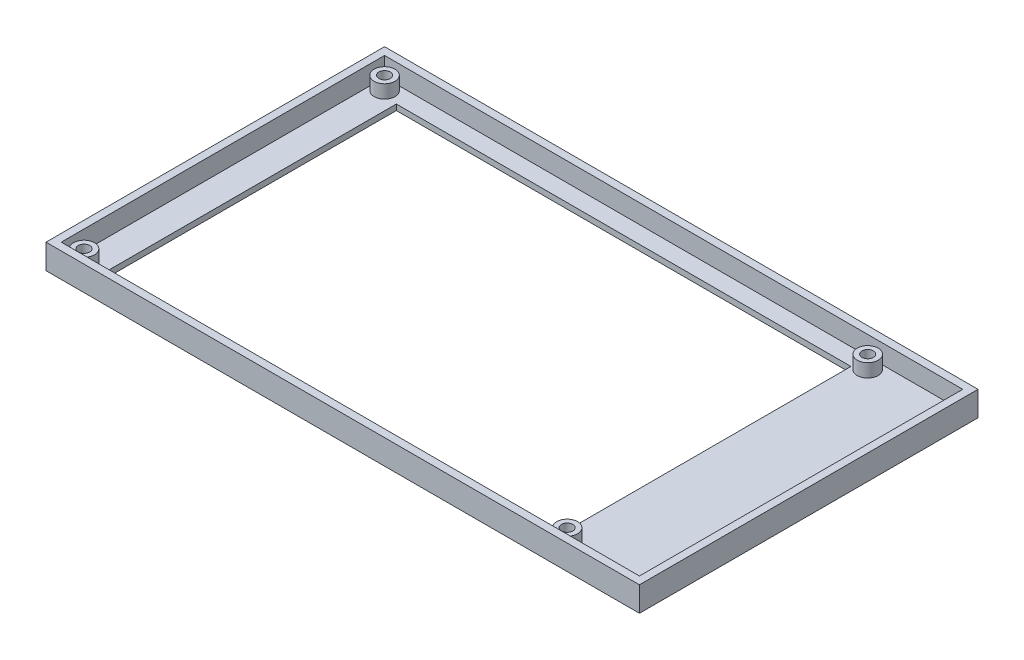
ISO-10303-21;
HEADER;
FILE_DESCRIPTION(('STEP AP214'),'2;1');
FILE_NAME('part.step','',(''),(''),'','','');
FILE_SCHEMA(('AUTOMOTIVE_DESIGN { 1 0 10303 214 1 1 1 1 }'));
ENDSEC;
DATA;
#1=APPLICATION_CONTEXT('core data for automotive mechanical design processes');
#2=APPLICATION_PROTOCOL_DEFINITION('international standard','automotive_design',2000,#1);
#3=PRODUCT_CONTEXT('',#1,'mechanical');
#4=PRODUCT('Part','Part','',(#3));
#5=PRODUCT_RELATED_PRODUCT_CATEGORY('part','',(#4));
#6=PRODUCT_DEFINITION_FORMATION('','',#4);
#7=PRODUCT_DEFINITION_CONTEXT('part definition',#1,'design');
#8=PRODUCT_DEFINITION('design','',#6,#7);
#9=PRODUCT_DEFINITION_SHAPE('','',#8);
#10=(LENGTH_UNIT() NAMED_UNIT(*) SI_UNIT(.MILLI.,.METRE.));
#11=(NAMED_UNIT(*) PLANE_ANGLE_UNIT() SI_UNIT($,.RADIAN.));
#12=(NAMED_UNIT(*) SI_UNIT($,.STERADIAN.) SOLID_ANGLE_UNIT());
#13=UNCERTAINTY_MEASURE_WITH_UNIT(LENGTH_MEASURE(1.E-05),#10,'distance_accuracy_value','');
#14=(GEOMETRIC_REPRESENTATION_CONTEXT(3) GLOBAL_UNCERTAINTY_ASSIGNED_CONTEXT((#13)) GLOBAL_UNIT_ASSIGNED_CONTEXT((#10,
#11,#12)) REPRESENTATION_CONTEXT('',''));
#15=CARTESIAN_POINT('',(0.,0.,0.));
#16=DIRECTION('',(0.,0.,1.));
#17=DIRECTION('',(1.,0.,0.));
#18=AXIS2_PLACEMENT_3D('',#15,#16,#17);
#19=CARTESIAN_POINT('',(0.,1.5,0.));
#20=DIRECTION('',(0.,-1.,0.));
#21=DIRECTION('',(0.,0.,-1.));
#22=AXIS2_PLACEMENT_3D('',#19,#20,#21);
#23=PLANE('',#22);
#24=DIRECTION('',(1.,0.,0.));
#25=VECTOR('',#24,1.);
#26=CARTESIAN_POINT('',(7.6,1.5,-2.));
#27=LINE('',#26,#25);
#28=CARTESIAN_POINT('',(7.6,1.5,-2.));
#29=VERTEX_POINT('',#28);
#30=CARTESIAN_POINT('',(127.1,1.5,-2.));
#31=VERTEX_POINT('',#30);
#32=EDGE_CURVE('E473',#29,#31,#27,.T.);
#33=ORIENTED_EDGE('',*,*,#32,.F.);
#34=DIRECTION('',(0.,0.,1.));
#35=VECTOR('',#34,1.);
#36=CARTESIAN_POINT('',(7.6,1.5,-80.5));
#37=LINE('',#36,#35);
#38=CARTESIAN_POINT('',(7.6,1.5,-80.5));
#39=VERTEX_POINT('',#38);
#40=EDGE_CURVE('E169',#39,#29,#37,.T.);
#41=ORIENTED_EDGE('',*,*,#40,.F.);
#42=DIRECTION('',(-1.,0.,0.));
#43=VECTOR('',#42,1.);
#44=CARTESIAN_POINT('',(7.6,1.5,-80.5));
#45=LINE('',#44,#43);
#46=CARTESIAN_POINT('',(127.1,1.5,-80.5));
#47=VERTEX_POINT('',#46);
#48=EDGE_CURVE('E165',#47,#39,#45,.T.);
#49=ORIENTED_EDGE('',*,*,#48,.F.);
#50=DIRECTION('',(0.,0.,-1.));
#51=VECTOR('',#50,1.);
#52=CARTESIAN_POINT('',(127.1,1.5,-80.5));
#53=LINE('',#52,#51);
#54=EDGE_CURVE('E137',#31,#47,#53,.T.);
#55=ORIENTED_EDGE('',*,*,#54,.F.);
#56=EDGE_LOOP('',(#33,#41,#49,#55));
#57=FACE_BOUND('',#56,.T.);
#58=CARTESIAN_POINT('',(3.,1.5,-3.));
#59=DIRECTION('',(0.,-1.,0.));
#60=DIRECTION('',(0.,0.,-1.));
#61=AXIS2_PLACEMENT_3D('',#58,#59,#60);
#62=CIRCLE('',#61,2.75);
#63=CARTESIAN_POINT('',(3.,1.5,-5.75));
#64=VERTEX_POINT('',#63);
#65=EDGE_CURVE('E11',#64,#64,#62,.F.);
#66=ORIENTED_EDGE('',*,*,#65,.F.);
#67=EDGE_LOOP('',(#66));
#68=FACE_BOUND('',#67,.T.);
#69=CARTESIAN_POINT('',(130.,1.5,-2.99999999999999));
#70=DIRECTION('',(0.,-1.,0.));
#71=DIRECTION('',(0.,0.,-1.));
#72=AXIS2_PLACEMENT_3D('',#69,#70,#71);
#73=CIRCLE('',#72,2.75000000000001);
#74=CARTESIAN_POINT('',(130.,1.5,-5.75));
#75=VERTEX_POINT('',#74);
#76=EDGE_CURVE('E50',#75,#75,#73,.F.);
#77=ORIENTED_EDGE('',*,*,#76,.F.);
#78=EDGE_LOOP('',(#77));
#79=FACE_BOUND('',#78,.T.);
#80=CARTESIAN_POINT('',(130.,1.5,-82.));
#81=DIRECTION('',(0.,-1.,0.));
#82=DIRECTION('',(0.,0.,-1.));
#83=AXIS2_PLACEMENT_3D('',#80,#81,#82);
#84=CIRCLE('',#83,2.75000000000001);
#85=CARTESIAN_POINT('',(130.,1.5,-84.75));
#86=VERTEX_POINT('',#85);
#87=EDGE_CURVE('E274',#86,#86,#84,.F.);
#88=ORIENTED_EDGE('',*,*,#87,.F.);
#89=EDGE_LOOP('',(#88));
#90=FACE_BOUND('',#89,.T.);
#91=CARTESIAN_POINT('',(3.,1.5,-82.));
#92=DIRECTION('',(0.,-1.,0.));
#93=DIRECTION('',(0.,0.,-1.));
#94=AXIS2_PLACEMENT_3D('',#91,#92,#93);
#95=CIRCLE('',#94,2.75);
#96=CARTESIAN_POINT('',(3.,1.5,-84.75));
#97=VERTEX_POINT('',#96);
#98=EDGE_CURVE('E270',#97,#97,#95,.F.);
#99=ORIENTED_EDGE('',*,*,#98,.F.);
#100=EDGE_LOOP('',(#99));
#101=FACE_BOUND('',#100,.T.);
#102=DIRECTION('',(0.,0.,1.));
#103=VECTOR('',#102,1.);
#104=CARTESIAN_POINT('',(0.,1.5,0.));
#105=LINE('',#104,#103);
#106=CARTESIAN_POINT('',(0.,1.5,-85.));
#107=VERTEX_POINT('',#106);
#108=CARTESIAN_POINT('',(0.,1.5,0.));
#109=VERTEX_POINT('',#108);
#110=EDGE_CURVE('E254',#107,#109,#105,.T.);
#111=ORIENTED_EDGE('',*,*,#110,.T.);
#112=DIRECTION('',(1.,0.,0.));
#113=VECTOR('',#112,1.);
#114=CARTESIAN_POINT('',(0.,1.5,0.));
#115=LINE('',#114,#113);
#116=CARTESIAN_POINT('',(152.,1.5,0.));
#117=VERTEX_POINT('',#116);
#118=EDGE_CURVE('E258',#109,#117,#115,.T.);
#119=ORIENTED_EDGE('',*,*,#118,.T.);
#120=DIRECTION('',(0.,0.,-1.));
#121=VECTOR('',#120,1.);
#122=CARTESIAN_POINT('',(152.,1.5,0.));
#123=LINE('',#122,#121);
#124=CARTESIAN_POINT('',(152.,1.5,-85.));
#125=VERTEX_POINT('',#124);
#126=EDGE_CURVE('E262',#117,#125,#123,.T.);
#127=ORIENTED_EDGE('',*,*,#126,.T.);
#128=DIRECTION('',(-1.,0.,0.));
#129=VECTOR('',#128,1.);
#130=CARTESIAN_POINT('',(0.,1.5,-85.));
#131=LINE('',#130,#129);
#132=EDGE_CURVE('E266',#125,#107,#131,.T.);
#133=ORIENTED_EDGE('',*,*,#132,.T.);
#134=EDGE_LOOP('',(#111,#119,#127,#133));
#135=FACE_BOUND('',#134,.T.);
#136=ADVANCED_FACE('F41',(#57,#68,#79,#90,#101,#135),#23,.F.);
#137=CARTESIAN_POINT('',(152.,6.5,-85.));
#138=DIRECTION('',(0.,0.,1.));
#139=DIRECTION('',(1.,0.,0.));
#140=AXIS2_PLACEMENT_3D('',#137,#138,#139);
#141=PLANE('',#140);
#142=ORIENTED_EDGE('',*,*,#132,.F.);
#143=DIRECTION('',(0.,-1.,0.));
#144=VECTOR('',#143,1.);
#145=CARTESIAN_POINT('',(152.,6.5,-85.));
#146=LINE('',#145,#144);
#147=CARTESIAN_POINT('',(152.,6.5,-85.));
#148=VERTEX_POINT('',#147);
#149=EDGE_CURVE('E214',#148,#125,#146,.T.);
#150=ORIENTED_EDGE('',*,*,#149,.F.);
#151=DIRECTION('',(-1.,0.,0.));
#152=VECTOR('',#151,1.);
#153=CARTESIAN_POINT('',(152.,6.5,-85.));
#154=LINE('',#153,#152);
#155=CARTESIAN_POINT('',(0.,6.5,-85.));
#156=VERTEX_POINT('',#155);
#157=EDGE_CURVE('E190',#148,#156,#154,.T.);
#158=ORIENTED_EDGE('',*,*,#157,.T.);
#159=DIRECTION('',(0.,-1.,0.));
#160=VECTOR('',#159,1.);
#161=CARTESIAN_POINT('',(0.,6.5,-85.));
#162=LINE('',#161,#160);
#163=EDGE_CURVE('E225',#156,#107,#162,.T.);
#164=ORIENTED_EDGE('',*,*,#163,.T.);
#165=EDGE_LOOP('',(#142,#150,#158,#164));
#166=FACE_BOUND('',#165,.T.);
#167=ADVANCED_FACE('F285',(#166),#141,.T.);
#168=CARTESIAN_POINT('',(0.,6.5,-85.));
#169=DIRECTION('',(1.,0.,0.));
#170=DIRECTION('',(0.,0.,-1.));
#171=AXIS2_PLACEMENT_3D('',#168,#169,#170);
#172=PLANE('',#171);
#173=ORIENTED_EDGE('',*,*,#110,.F.);
#174=ORIENTED_EDGE('',*,*,#163,.F.);
#175=DIRECTION('',(0.,0.,1.));
#176=VECTOR('',#175,1.);
#177=CARTESIAN_POINT('',(0.,6.5,-85.));
#178=LINE('',#177,#176);
#179=CARTESIAN_POINT('',(0.,6.5,0.));
#180=VERTEX_POINT('',#179);
#181=EDGE_CURVE('E204',#156,#180,#178,.T.);
#182=ORIENTED_EDGE('',*,*,#181,.T.);
#183=DIRECTION('',(0.,-1.,0.));
#184=VECTOR('',#183,1.);
#185=CARTESIAN_POINT('',(0.,6.5,0.));
#186=LINE('',#185,#184);
#187=EDGE_CURVE('E221',#180,#109,#186,.T.);
#188=ORIENTED_EDGE('',*,*,#187,.T.);
#189=EDGE_LOOP('',(#173,#174,#182,#188));
#190=FACE_BOUND('',#189,.T.);
#191=ADVANCED_FACE('F294',(#190),#172,.T.);
#192=CARTESIAN_POINT('',(0.,6.5,0.));
#193=DIRECTION('',(0.,0.,-1.));
#194=DIRECTION('',(-1.,0.,0.));
#195=AXIS2_PLACEMENT_3D('',#192,#193,#194);
#196=PLANE('',#195);
#197=ORIENTED_EDGE('',*,*,#118,.F.);
#198=ORIENTED_EDGE('',*,*,#187,.F.);
#199=DIRECTION('',(1.,0.,0.));
#200=VECTOR('',#199,1.);
#201=CARTESIAN_POINT('',(0.,6.5,0.));
#202=LINE('',#201,#200);
#203=CARTESIAN_POINT('',(152.,6.5,0.));
#204=VERTEX_POINT('',#203);
#205=EDGE_CURVE('E207',#180,#204,#202,.T.);
#206=ORIENTED_EDGE('',*,*,#205,.T.);
#207=DIRECTION('',(0.,-1.,0.));
#208=VECTOR('',#207,1.);
#209=CARTESIAN_POINT('',(152.,6.5,0.));
#210=LINE('',#209,#208);
#211=EDGE_CURVE('E217',#204,#117,#210,.T.);
#212=ORIENTED_EDGE('',*,*,#211,.T.);
#213=EDGE_LOOP('',(#197,#198,#206,#212));
#214=FACE_BOUND('',#213,.T.);
#215=ADVANCED_FACE('F305',(#214),#196,.T.);
#216=CARTESIAN_POINT('',(152.,6.5,0.));
#217=DIRECTION('',(-1.,0.,0.));
#218=DIRECTION('',(0.,0.,1.));
#219=AXIS2_PLACEMENT_3D('',#216,#217,#218);
#220=PLANE('',#219);
#221=ORIENTED_EDGE('',*,*,#126,.F.);
#222=ORIENTED_EDGE('',*,*,#211,.F.);
#223=DIRECTION('',(0.,0.,-1.));
#224=VECTOR('',#223,1.);
#225=CARTESIAN_POINT('',(152.,6.5,0.));
#226=LINE('',#225,#224);
#227=EDGE_CURVE('E211',#204,#148,#226,.T.);
#228=ORIENTED_EDGE('',*,*,#227,.T.);
#229=ORIENTED_EDGE('',*,*,#149,.T.);
#230=EDGE_LOOP('',(#221,#222,#228,#229));
#231=FACE_BOUND('',#230,.T.);
#232=ADVANCED_FACE('F307',(#231),#220,.T.);
#233=CARTESIAN_POINT('',(0.,6.5,0.));
#234=DIRECTION('',(0.,1.,0.));
#235=DIRECTION('',(0.,0.,1.));
#236=AXIS2_PLACEMENT_3D('',#233,#234,#235);
#237=PLANE('',#236);
#238=DIRECTION('',(0.,0.,-1.));
#239=VECTOR('',#238,1.);
#240=CARTESIAN_POINT('',(154.,6.5,2.));
#241=LINE('',#240,#239);
#242=CARTESIAN_POINT('',(154.,6.5,2.));
#243=VERTEX_POINT('',#242);
#244=CARTESIAN_POINT('',(154.,6.5,-87.));
#245=VERTEX_POINT('',#244);
#246=EDGE_CURVE('E229',#243,#245,#241,.T.);
#247=ORIENTED_EDGE('',*,*,#246,.T.);
#248=DIRECTION('',(-1.,0.,0.));
#249=VECTOR('',#248,1.);
#250=CARTESIAN_POINT('',(154.,6.5,-87.));
#251=LINE('',#250,#249);
#252=CARTESIAN_POINT('',(-2.,6.5,-87.));
#253=VERTEX_POINT('',#252);
#254=EDGE_CURVE('E233',#245,#253,#251,.T.);
#255=ORIENTED_EDGE('',*,*,#254,.T.);
#256=DIRECTION('',(0.,0.,1.));
#257=VECTOR('',#256,1.);
#258=CARTESIAN_POINT('',(-2.,6.5,-87.));
#259=LINE('',#258,#257);
#260=CARTESIAN_POINT('',(-2.,6.5,2.));
#261=VERTEX_POINT('',#260);
#262=EDGE_CURVE('E236',#253,#261,#259,.T.);
#263=ORIENTED_EDGE('',*,*,#262,.T.);
#264=DIRECTION('',(1.,0.,0.));
#265=VECTOR('',#264,1.);
#266=CARTESIAN_POINT('',(-2.,6.5,2.));
#267=LINE('',#266,#265);
#268=EDGE_CURVE('E239',#261,#243,#267,.T.);
#269=ORIENTED_EDGE('',*,*,#268,.T.);
#270=EDGE_LOOP('',(#247,#255,#263,#269));
#271=FACE_BOUND('',#270,.T.);
#272=ORIENTED_EDGE('',*,*,#181,.F.);
#273=ORIENTED_EDGE('',*,*,#157,.F.);
#274=ORIENTED_EDGE('',*,*,#227,.F.);
#275=ORIENTED_EDGE('',*,*,#205,.F.);
#276=EDGE_LOOP('',(#272,#273,#274,#275));
#277=FACE_BOUND('',#276,.T.);
#278=ADVANCED_FACE('F302',(#271,#277),#237,.T.);
#279=CARTESIAN_POINT('',(154.,6.5,2.));
#280=DIRECTION('',(-1.,0.,0.));
#281=DIRECTION('',(0.,0.,1.));
#282=AXIS2_PLACEMENT_3D('',#279,#280,#281);
#283=PLANE('',#282);
#284=DIRECTION('',(0.,-1.,0.));
#285=VECTOR('',#284,1.);
#286=CARTESIAN_POINT('',(154.,6.5,2.));
#287=LINE('',#286,#285);
#288=CARTESIAN_POINT('',(154.,0.,2.));
#289=VERTEX_POINT('',#288);
#290=EDGE_CURVE('E242',#243,#289,#287,.T.);
#291=ORIENTED_EDGE('',*,*,#290,.T.);
#292=DIRECTION('',(0.,0.,-1.));
#293=VECTOR('',#292,1.);
#294=CARTESIAN_POINT('',(154.,0.,2.));
#295=LINE('',#294,#293);
#296=CARTESIAN_POINT('',(154.,0.,-87.));
#297=VERTEX_POINT('',#296);
#298=EDGE_CURVE('E185',#289,#297,#295,.T.);
#299=ORIENTED_EDGE('',*,*,#298,.T.);
#300=DIRECTION('',(0.,-1.,0.));
#301=VECTOR('',#300,1.);
#302=CARTESIAN_POINT('',(154.,6.5,-87.));
#303=LINE('',#302,#301);
#304=EDGE_CURVE('E251',#245,#297,#303,.T.);
#305=ORIENTED_EDGE('',*,*,#304,.F.);
#306=ORIENTED_EDGE('',*,*,#246,.F.);
#307=EDGE_LOOP('',(#291,#299,#305,#306));
#308=FACE_BOUND('',#307,.T.);
#309=ADVANCED_FACE('F314',(#308),#283,.F.);
#310=CARTESIAN_POINT('',(154.,6.5,-87.));
#311=DIRECTION('',(0.,0.,1.));
#312=DIRECTION('',(1.,0.,0.));
#313=AXIS2_PLACEMENT_3D('',#310,#311,#312);
#314=PLANE('',#313);
#315=ORIENTED_EDGE('',*,*,#304,.T.);
#316=DIRECTION('',(-1.,0.,0.));
#317=VECTOR('',#316,1.);
#318=CARTESIAN_POINT('',(154.,0.,-87.));
#319=LINE('',#318,#317);
#320=CARTESIAN_POINT('',(-2.,0.,-87.));
#321=VERTEX_POINT('',#320);
#322=EDGE_CURVE('E186',#297,#321,#319,.T.);
#323=ORIENTED_EDGE('',*,*,#322,.T.);
#324=DIRECTION('',(0.,-1.,0.));
#325=VECTOR('',#324,1.);
#326=CARTESIAN_POINT('',(-2.,6.5,-87.));
#327=LINE('',#326,#325);
#328=EDGE_CURVE('E248',#253,#321,#327,.T.);
#329=ORIENTED_EDGE('',*,*,#328,.F.);
#330=ORIENTED_EDGE('',*,*,#254,.F.);
#331=EDGE_LOOP('',(#315,#323,#329,#330));
#332=FACE_BOUND('',#331,.T.);
#333=ADVANCED_FACE('F333',(#332),#314,.F.);
#334=CARTESIAN_POINT('',(-2.,6.5,-87.));
#335=DIRECTION('',(1.,0.,0.));
#336=DIRECTION('',(0.,0.,-1.));
#337=AXIS2_PLACEMENT_3D('',#334,#335,#336);
#338=PLANE('',#337);
#339=ORIENTED_EDGE('',*,*,#328,.T.);
#340=DIRECTION('',(0.,0.,1.));
#341=VECTOR('',#340,1.);
#342=CARTESIAN_POINT('',(-2.,0.,-87.));
#343=LINE('',#342,#341);
#344=CARTESIAN_POINT('',(-2.,0.,2.));
#345=VERTEX_POINT('',#344);
#346=EDGE_CURVE('E191',#321,#345,#343,.T.);
#347=ORIENTED_EDGE('',*,*,#346,.T.);
#348=DIRECTION('',(0.,-1.,0.));
#349=VECTOR('',#348,1.);
#350=CARTESIAN_POINT('',(-2.,6.5,2.));
#351=LINE('',#350,#349);
#352=EDGE_CURVE('E245',#261,#345,#351,.T.);
#353=ORIENTED_EDGE('',*,*,#352,.F.);
#354=ORIENTED_EDGE('',*,*,#262,.F.);
#355=EDGE_LOOP('',(#339,#347,#353,#354));
#356=FACE_BOUND('',#355,.T.);
#357=ADVANCED_FACE('F329',(#356),#338,.F.);
#358=CARTESIAN_POINT('',(-2.,6.5,2.));
#359=DIRECTION('',(0.,0.,-1.));
#360=DIRECTION('',(-1.,0.,0.));
#361=AXIS2_PLACEMENT_3D('',#358,#359,#360);
#362=PLANE('',#361);
#363=ORIENTED_EDGE('',*,*,#352,.T.);
#364=DIRECTION('',(1.,0.,0.));
#365=VECTOR('',#364,1.);
#366=CARTESIAN_POINT('',(-2.,0.,2.));
#367=LINE('',#366,#365);
#368=EDGE_CURVE('E195',#345,#289,#367,.T.);
#369=ORIENTED_EDGE('',*,*,#368,.T.);
#370=ORIENTED_EDGE('',*,*,#290,.F.);
#371=ORIENTED_EDGE('',*,*,#268,.F.);
#372=EDGE_LOOP('',(#363,#369,#370,#371));
#373=FACE_BOUND('',#372,.T.);
#374=ADVANCED_FACE('F326',(#373),#362,.F.);
#375=CARTESIAN_POINT('',(0.,0.,0.));
#376=DIRECTION('',(0.,-1.,0.));
#377=DIRECTION('',(0.,0.,-1.));
#378=AXIS2_PLACEMENT_3D('',#375,#376,#377);
#379=PLANE('',#378);
#380=DIRECTION('',(0.,0.,-1.));
#381=VECTOR('',#380,1.);
#382=CARTESIAN_POINT('',(7.6,0.,-80.5));
#383=LINE('',#382,#381);
#384=CARTESIAN_POINT('',(7.6,0.,-2.));
#385=VERTEX_POINT('',#384);
#386=CARTESIAN_POINT('',(7.6,0.,-80.5));
#387=VERTEX_POINT('',#386);
#388=EDGE_CURVE('E65',#385,#387,#383,.T.);
#389=ORIENTED_EDGE('',*,*,#388,.F.);
#390=DIRECTION('',(-1.,0.,0.));
#391=VECTOR('',#390,1.);
#392=CARTESIAN_POINT('',(7.6,0.,-2.));
#393=LINE('',#392,#391);
#394=CARTESIAN_POINT('',(127.1,0.,-2.));
#395=VERTEX_POINT('',#394);
#396=EDGE_CURVE('E151',#395,#385,#393,.T.);
#397=ORIENTED_EDGE('',*,*,#396,.F.);
#398=DIRECTION('',(0.,0.,1.));
#399=VECTOR('',#398,1.);
#400=CARTESIAN_POINT('',(127.1,0.,-80.5));
#401=LINE('',#400,#399);
#402=CARTESIAN_POINT('',(127.1,0.,-80.5));
#403=VERTEX_POINT('',#402);
#404=EDGE_CURVE('E134',#403,#395,#401,.T.);
#405=ORIENTED_EDGE('',*,*,#404,.F.);
#406=DIRECTION('',(1.,0.,0.));
#407=VECTOR('',#406,1.);
#408=CARTESIAN_POINT('',(7.6,0.,-80.5));
#409=LINE('',#408,#407);
#410=EDGE_CURVE('E144',#387,#403,#409,.T.);
#411=ORIENTED_EDGE('',*,*,#410,.F.);
#412=EDGE_LOOP('',(#389,#397,#405,#411));
#413=FACE_BOUND('',#412,.T.);
#414=ORIENTED_EDGE('',*,*,#298,.F.);
#415=ORIENTED_EDGE('',*,*,#368,.F.);
#416=ORIENTED_EDGE('',*,*,#346,.F.);
#417=ORIENTED_EDGE('',*,*,#322,.F.);
#418=EDGE_LOOP('',(#414,#415,#416,#417));
#419=FACE_BOUND('',#418,.T.);
#420=ADVANCED_FACE('F43',(#413,#419),#379,.T.);
#421=CARTESIAN_POINT('',(3.,5.,-82.));
#422=DIRECTION('',(0.,-1.,0.));
#423=DIRECTION('',(0.,0.,-1.));
#424=AXIS2_PLACEMENT_3D('',#421,#422,#423);
#425=CYLINDRICAL_SURFACE('',#424,2.75);
#426=CARTESIAN_POINT('',(3.,5.,-82.));
#427=DIRECTION('',(0.,1.,0.));
#428=DIRECTION('',(0.,0.,1.));
#429=AXIS2_PLACEMENT_3D('',#426,#427,#428);
#430=CIRCLE('',#429,2.75);
#431=CARTESIAN_POINT('',(3.,5.,-79.25));
#432=VERTEX_POINT('',#431);
#433=EDGE_CURVE('E181',#432,#432,#430,.T.);
#434=ORIENTED_EDGE('',*,*,#433,.F.);
#435=EDGE_LOOP('',(#434));
#436=FACE_BOUND('',#435,.T.);
#437=ORIENTED_EDGE('',*,*,#98,.T.);
#438=EDGE_LOOP('',(#437));
#439=FACE_BOUND('',#438,.T.);
#440=ADVANCED_FACE('F319',(#436,#439),#425,.T.);
#441=CARTESIAN_POINT('',(3.,5.,-82.));
#442=DIRECTION('',(0.,1.,0.));
#443=DIRECTION('',(0.,0.,1.));
#444=AXIS2_PLACEMENT_3D('',#441,#442,#443);
#445=PLANE('',#444);
#446=CARTESIAN_POINT('',(3.,5.,-82.));
#447=DIRECTION('',(0.,1.,0.));
#448=DIRECTION('',(0.,0.,1.));
#449=AXIS2_PLACEMENT_3D('',#446,#447,#448);
#450=CIRCLE('',#449,1.5);
#451=CARTESIAN_POINT('',(3.,5.,-80.5));
#452=VERTEX_POINT('',#451);
#453=EDGE_CURVE('E456',#452,#452,#450,.T.);
#454=ORIENTED_EDGE('',*,*,#453,.F.);
#455=EDGE_LOOP('',(#454));
#456=FACE_BOUND('',#455,.T.);
#457=ORIENTED_EDGE('',*,*,#433,.T.);
#458=EDGE_LOOP('',(#457));
#459=FACE_BOUND('',#458,.T.);
#460=ADVANCED_FACE('F357',(#456,#459),#445,.T.);
#461=CARTESIAN_POINT('',(130.,5.,-82.));
#462=DIRECTION('',(0.,-1.,0.));
#463=DIRECTION('',(0.,0.,-1.));
#464=AXIS2_PLACEMENT_3D('',#461,#462,#463);
#465=CYLINDRICAL_SURFACE('',#464,2.75000000000001);
#466=CARTESIAN_POINT('',(130.,5.,-82.));
#467=DIRECTION('',(0.,1.,0.));
#468=DIRECTION('',(0.,0.,1.));
#469=AXIS2_PLACEMENT_3D('',#466,#467,#468);
#470=CIRCLE('',#469,2.75000000000001);
#471=CARTESIAN_POINT('',(130.,5.,-79.25));
#472=VERTEX_POINT('',#471);
#473=EDGE_CURVE('E177',#472,#472,#470,.T.);
#474=ORIENTED_EDGE('',*,*,#473,.F.);
#475=EDGE_LOOP('',(#474));
#476=FACE_BOUND('',#475,.T.);
#477=ORIENTED_EDGE('',*,*,#87,.T.);
#478=EDGE_LOOP('',(#477));
#479=FACE_BOUND('',#478,.T.);
#480=ADVANCED_FACE('F362',(#476,#479),#465,.T.);
#481=CARTESIAN_POINT('',(130.,5.,-82.));
#482=DIRECTION('',(0.,1.,0.));
#483=DIRECTION('',(0.,0.,1.));
#484=AXIS2_PLACEMENT_3D('',#481,#482,#483);
#485=PLANE('',#484);
#486=CARTESIAN_POINT('',(130.,5.,-82.));
#487=DIRECTION('',(0.,1.,0.));
#488=DIRECTION('',(0.,0.,1.));
#489=AXIS2_PLACEMENT_3D('',#486,#487,#488);
#490=CIRCLE('',#489,1.5);
#491=CARTESIAN_POINT('',(130.,5.,-80.5));
#492=VERTEX_POINT('',#491);
#493=EDGE_CURVE('E464',#492,#492,#490,.T.);
#494=ORIENTED_EDGE('',*,*,#493,.F.);
#495=EDGE_LOOP('',(#494));
#496=FACE_BOUND('',#495,.T.);
#497=ORIENTED_EDGE('',*,*,#473,.T.);
#498=EDGE_LOOP('',(#497));
#499=FACE_BOUND('',#498,.T.);
#500=ADVANCED_FACE('F370',(#496,#499),#485,.T.);
#501=CARTESIAN_POINT('',(130.,5.,-2.99999999999999));
#502=DIRECTION('',(0.,-1.,0.));
#503=DIRECTION('',(0.,0.,-1.));
#504=AXIS2_PLACEMENT_3D('',#501,#502,#503);
#505=CYLINDRICAL_SURFACE('',#504,2.75000000000001);
#506=CARTESIAN_POINT('',(130.,5.,-2.99999999999999));
#507=DIRECTION('',(0.,1.,0.));
#508=DIRECTION('',(0.,0.,-1.));
#509=AXIS2_PLACEMENT_3D('',#506,#507,#508);
#510=CIRCLE('',#509,2.75000000000001);
#511=CARTESIAN_POINT('',(130.,5.,-5.75));
#512=VERTEX_POINT('',#511);
#513=EDGE_CURVE('E173',#512,#512,#510,.T.);
#514=ORIENTED_EDGE('',*,*,#513,.F.);
#515=EDGE_LOOP('',(#514));
#516=FACE_BOUND('',#515,.T.);
#517=ORIENTED_EDGE('',*,*,#76,.T.);
#518=EDGE_LOOP('',(#517));
#519=FACE_BOUND('',#518,.T.);
#520=ADVANCED_FACE('F281',(#516,#519),#505,.T.);
#521=CARTESIAN_POINT('',(130.,5.,-2.99999999999999));
#522=DIRECTION('',(0.,-1.,0.));
#523=DIRECTION('',(0.,0.,-1.));
#524=AXIS2_PLACEMENT_3D('',#521,#522,#523);
#525=PLANE('',#524);
#526=CARTESIAN_POINT('',(130.,5.,-2.99999999999999));
#527=DIRECTION('',(0.,1.,0.));
#528=DIRECTION('',(0.,0.,1.));
#529=AXIS2_PLACEMENT_3D('',#526,#527,#528);
#530=CIRCLE('',#529,1.5);
#531=CARTESIAN_POINT('',(130.,5.,-1.49999999999999));
#532=VERTEX_POINT('',#531);
#533=EDGE_CURVE('E441',#532,#532,#530,.T.);
#534=ORIENTED_EDGE('',*,*,#533,.F.);
#535=EDGE_LOOP('',(#534));
#536=FACE_BOUND('',#535,.T.);
#537=ORIENTED_EDGE('',*,*,#513,.T.);
#538=EDGE_LOOP('',(#537));
#539=FACE_BOUND('',#538,.T.);
#540=ADVANCED_FACE('F380',(#536,#539),#525,.F.);
#541=CARTESIAN_POINT('',(3.,5.,-3.));
#542=DIRECTION('',(0.,-1.,0.));
#543=DIRECTION('',(0.,0.,-1.));
#544=AXIS2_PLACEMENT_3D('',#541,#542,#543);
#545=CYLINDRICAL_SURFACE('',#544,2.75);
#546=CARTESIAN_POINT('',(3.,5.,-3.));
#547=DIRECTION('',(0.,1.,0.));
#548=DIRECTION('',(0.,0.,-1.));
#549=AXIS2_PLACEMENT_3D('',#546,#547,#548);
#550=CIRCLE('',#549,2.75);
#551=CARTESIAN_POINT('',(3.,5.,-5.75));
#552=VERTEX_POINT('',#551);
#553=EDGE_CURVE('E168',#552,#552,#550,.T.);
#554=ORIENTED_EDGE('',*,*,#553,.F.);
#555=EDGE_LOOP('',(#554));
#556=FACE_BOUND('',#555,.T.);
#557=ORIENTED_EDGE('',*,*,#65,.T.);
#558=EDGE_LOOP('',(#557));
#559=FACE_BOUND('',#558,.T.);
#560=ADVANCED_FACE('F384',(#556,#559),#545,.T.);
#561=CARTESIAN_POINT('',(3.,5.,-3.));
#562=DIRECTION('',(0.,-1.,0.));
#563=DIRECTION('',(0.,0.,-1.));
#564=AXIS2_PLACEMENT_3D('',#561,#562,#563);
#565=PLANE('',#564);
#566=CARTESIAN_POINT('',(3.,5.,-3.));
#567=DIRECTION('',(0.,1.,0.));
#568=DIRECTION('',(0.,0.,1.));
#569=AXIS2_PLACEMENT_3D('',#566,#567,#568);
#570=CIRCLE('',#569,1.5);
#571=CARTESIAN_POINT('',(3.,5.,-1.5));
#572=VERTEX_POINT('',#571);
#573=EDGE_CURVE('E442',#572,#572,#570,.T.);
#574=ORIENTED_EDGE('',*,*,#573,.F.);
#575=EDGE_LOOP('',(#574));
#576=FACE_BOUND('',#575,.T.);
#577=ORIENTED_EDGE('',*,*,#553,.T.);
#578=EDGE_LOOP('',(#577));
#579=FACE_BOUND('',#578,.T.);
#580=ADVANCED_FACE('F388',(#576,#579),#565,.F.);
#581=CARTESIAN_POINT('',(7.6,144.47727092094,-80.5));
#582=DIRECTION('',(-1.,0.,0.));
#583=DIRECTION('',(0.,0.,1.));
#584=AXIS2_PLACEMENT_3D('',#581,#582,#583);
#585=PLANE('',#584);
#586=ORIENTED_EDGE('',*,*,#40,.T.);
#587=DIRECTION('',(0.,-1.,0.));
#588=VECTOR('',#587,1.);
#589=CARTESIAN_POINT('',(7.6,144.47727092094,-2.));
#590=LINE('',#589,#588);
#591=EDGE_CURVE('E158',#29,#385,#590,.T.);
#592=ORIENTED_EDGE('',*,*,#591,.T.);
#593=ORIENTED_EDGE('',*,*,#388,.T.);
#594=DIRECTION('',(0.,-1.,0.));
#595=VECTOR('',#594,1.);
#596=CARTESIAN_POINT('',(7.6,144.47727092094,-80.5));
#597=LINE('',#596,#595);
#598=EDGE_CURVE('E141',#39,#387,#597,.T.);
#599=ORIENTED_EDGE('',*,*,#598,.F.);
#600=EDGE_LOOP('',(#586,#592,#593,#599));
#601=FACE_BOUND('',#600,.T.);
#602=ADVANCED_FACE('F392',(#601),#585,.F.);
#603=CARTESIAN_POINT('',(7.6,144.47727092094,-2.));
#604=DIRECTION('',(0.,0.,1.));
#605=DIRECTION('',(1.,0.,0.));
#606=AXIS2_PLACEMENT_3D('',#603,#604,#605);
#607=PLANE('',#606);
#608=ORIENTED_EDGE('',*,*,#32,.T.);
#609=DIRECTION('',(0.,-1.,0.));
#610=VECTOR('',#609,1.);
#611=CARTESIAN_POINT('',(127.1,144.47727092094,-2.));
#612=LINE('',#611,#610);
#613=EDGE_CURVE('E140',#31,#395,#612,.T.);
#614=ORIENTED_EDGE('',*,*,#613,.T.);
#615=ORIENTED_EDGE('',*,*,#396,.T.);
#616=ORIENTED_EDGE('',*,*,#591,.F.);
#617=EDGE_LOOP('',(#608,#614,#615,#616));
#618=FACE_BOUND('',#617,.T.);
#619=ADVANCED_FACE('F396',(#618),#607,.F.);
#620=CARTESIAN_POINT('',(127.1,144.47727092094,-80.5));
#621=DIRECTION('',(1.,0.,0.));
#622=DIRECTION('',(0.,0.,-1.));
#623=AXIS2_PLACEMENT_3D('',#620,#621,#622);
#624=PLANE('',#623);
#625=ORIENTED_EDGE('',*,*,#54,.T.);
#626=DIRECTION('',(0.,-1.,0.));
#627=VECTOR('',#626,1.);
#628=CARTESIAN_POINT('',(127.1,144.47727092094,-80.5));
#629=LINE('',#628,#627);
#630=EDGE_CURVE('E57',#47,#403,#629,.T.);
#631=ORIENTED_EDGE('',*,*,#630,.T.);
#632=ORIENTED_EDGE('',*,*,#404,.T.);
#633=ORIENTED_EDGE('',*,*,#613,.F.);
#634=EDGE_LOOP('',(#625,#631,#632,#633));
#635=FACE_BOUND('',#634,.T.);
#636=ADVANCED_FACE('F131',(#635),#624,.F.);
#637=CARTESIAN_POINT('',(7.6,144.47727092094,-80.5));
#638=DIRECTION('',(0.,0.,-1.));
#639=DIRECTION('',(-1.,0.,0.));
#640=AXIS2_PLACEMENT_3D('',#637,#638,#639);
#641=PLANE('',#640);
#642=ORIENTED_EDGE('',*,*,#48,.T.);
#643=ORIENTED_EDGE('',*,*,#598,.T.);
#644=ORIENTED_EDGE('',*,*,#410,.T.);
#645=ORIENTED_EDGE('',*,*,#630,.F.);
#646=EDGE_LOOP('',(#642,#643,#644,#645));
#647=FACE_BOUND('',#646,.T.);
#648=ADVANCED_FACE('F145',(#647),#641,.F.);
#649=CARTESIAN_POINT('',(3.,2.,-3.));
#650=DIRECTION('',(0.,1.,0.));
#651=DIRECTION('',(0.,0.,1.));
#652=AXIS2_PLACEMENT_3D('',#649,#650,#651);
#653=CYLINDRICAL_SURFACE('',#652,1.5);
#654=CARTESIAN_POINT('',(3.,2.,-3.));
#655=DIRECTION('',(0.,1.,0.));
#656=DIRECTION('',(0.,0.,1.));
#657=AXIS2_PLACEMENT_3D('',#654,#655,#656);
#658=CIRCLE('',#657,1.5);
#659=CARTESIAN_POINT('',(3.,2.,-1.5));
#660=VERTEX_POINT('',#659);
#661=EDGE_CURVE('E439',#660,#660,#658,.T.);
#662=ORIENTED_EDGE('',*,*,#661,.F.);
#663=EDGE_LOOP('',(#662));
#664=FACE_BOUND('',#663,.T.);
#665=ORIENTED_EDGE('',*,*,#573,.T.);
#666=EDGE_LOOP('',(#665));
#667=FACE_BOUND('',#666,.T.);
#668=ADVANCED_FACE('F399',(#664,#667),#653,.F.);
#669=CARTESIAN_POINT('',(3.,2.,-3.));
#670=DIRECTION('',(0.,1.,0.));
#671=DIRECTION('',(0.,0.,1.));
#672=AXIS2_PLACEMENT_3D('',#669,#670,#671);
#673=PLANE('',#672);
#674=ORIENTED_EDGE('',*,*,#661,.T.);
#675=EDGE_LOOP('',(#674));
#676=FACE_BOUND('',#675,.T.);
#677=ADVANCED_FACE('F409',(#676),#673,.T.);
#678=CARTESIAN_POINT('',(130.,2.,-2.99999999999999));
#679=DIRECTION('',(0.,1.,0.));
#680=DIRECTION('',(0.,0.,1.));
#681=AXIS2_PLACEMENT_3D('',#678,#679,#680);
#682=CYLINDRICAL_SURFACE('',#681,1.5);
#683=CARTESIAN_POINT('',(130.,2.,-2.99999999999999));
#684=DIRECTION('',(0.,1.,0.));
#685=DIRECTION('',(0.,0.,1.));
#686=AXIS2_PLACEMENT_3D('',#683,#684,#685);
#687=CIRCLE('',#686,1.5);
#688=CARTESIAN_POINT('',(130.,2.,-1.49999999999999));
#689=VERTEX_POINT('',#688);
#690=EDGE_CURVE('E447',#689,#689,#687,.T.);
#691=ORIENTED_EDGE('',*,*,#690,.F.);
#692=EDGE_LOOP('',(#691));
#693=FACE_BOUND('',#692,.T.);
#694=ORIENTED_EDGE('',*,*,#533,.T.);
#695=EDGE_LOOP('',(#694));
#696=FACE_BOUND('',#695,.T.);
#697=ADVANCED_FACE('F405',(#693,#696),#682,.F.);
#698=CARTESIAN_POINT('',(130.,2.,-2.99999999999999));
#699=DIRECTION('',(0.,1.,0.));
#700=DIRECTION('',(0.,0.,1.));
#701=AXIS2_PLACEMENT_3D('',#698,#699,#700);
#702=PLANE('',#701);
#703=ORIENTED_EDGE('',*,*,#690,.T.);
#704=EDGE_LOOP('',(#703));
#705=FACE_BOUND('',#704,.T.);
#706=ADVANCED_FACE('F408',(#705),#702,.T.);
#707=CARTESIAN_POINT('',(130.,2.,-82.));
#708=DIRECTION('',(0.,1.,0.));
#709=DIRECTION('',(0.,0.,1.));
#710=AXIS2_PLACEMENT_3D('',#707,#708,#709);
#711=CYLINDRICAL_SURFACE('',#710,1.5);
#712=CARTESIAN_POINT('',(130.,2.,-82.));
#713=DIRECTION('',(0.,1.,0.));
#714=DIRECTION('',(0.,0.,1.));
#715=AXIS2_PLACEMENT_3D('',#712,#713,#714);
#716=CIRCLE('',#715,1.5);
#717=CARTESIAN_POINT('',(130.,2.,-80.5));
#718=VERTEX_POINT('',#717);
#719=EDGE_CURVE('E460',#718,#718,#716,.T.);
#720=ORIENTED_EDGE('',*,*,#719,.F.);
#721=EDGE_LOOP('',(#720));
#722=FACE_BOUND('',#721,.T.);
#723=ORIENTED_EDGE('',*,*,#493,.T.);
#724=EDGE_LOOP('',(#723));
#725=FACE_BOUND('',#724,.T.);
#726=ADVANCED_FACE('F413',(#722,#725),#711,.F.);
#727=CARTESIAN_POINT('',(130.,2.,-82.));
#728=DIRECTION('',(0.,1.,0.));
#729=DIRECTION('',(0.,0.,1.));
#730=AXIS2_PLACEMENT_3D('',#727,#728,#729);
#731=PLANE('',#730);
#732=ORIENTED_EDGE('',*,*,#719,.T.);
#733=EDGE_LOOP('',(#732));
#734=FACE_BOUND('',#733,.T.);
#735=ADVANCED_FACE('F417',(#734),#731,.T.);
#736=CARTESIAN_POINT('',(3.,2.,-82.));
#737=DIRECTION('',(0.,1.,0.));
#738=DIRECTION('',(0.,0.,1.));
#739=AXIS2_PLACEMENT_3D('',#736,#737,#738);
#740=CYLINDRICAL_SURFACE('',#739,1.5);
#741=CARTESIAN_POINT('',(3.,2.,-82.));
#742=DIRECTION('',(0.,1.,0.));
#743=DIRECTION('',(0.,0.,1.));
#744=AXIS2_PLACEMENT_3D('',#741,#742,#743);
#745=CIRCLE('',#744,1.5);
#746=CARTESIAN_POINT('',(3.,2.,-80.5));
#747=VERTEX_POINT('',#746);
#748=EDGE_CURVE('E450',#747,#747,#745,.T.);
#749=ORIENTED_EDGE('',*,*,#748,.F.);
#750=EDGE_LOOP('',(#749));
#751=FACE_BOUND('',#750,.T.);
#752=ORIENTED_EDGE('',*,*,#453,.T.);
#753=EDGE_LOOP('',(#752));
#754=FACE_BOUND('',#753,.T.);
#755=ADVANCED_FACE('F421',(#751,#754),#740,.F.);
#756=CARTESIAN_POINT('',(3.,2.,-82.));
#757=DIRECTION('',(0.,1.,0.));
#758=DIRECTION('',(0.,0.,1.));
#759=AXIS2_PLACEMENT_3D('',#756,#757,#758);
#760=PLANE('',#759);
#761=ORIENTED_EDGE('',*,*,#748,.T.);
#762=EDGE_LOOP('',(#761));
#763=FACE_BOUND('',#762,.T.);
#764=ADVANCED_FACE('F425',(#763),#760,.T.);
#765=CLOSED_SHELL('',(#136,#167,#191,#215,#232,#278,#309,#333,#357,#374,#420,#440,#460,#480,
#500,#520,#540,#560,#580,#602,#619,#636,#648,#668,#677,#697,#706,#726,#735,#755,#764));
#766=MANIFOLD_SOLID_BREP('B2',#765);
#767=ADVANCED_BREP_SHAPE_REPRESENTATION('',(#18,#766),#14);
#768=SHAPE_DEFINITION_REPRESENTATION(#9,#767);
ENDSEC;
END-ISO-10303-21;
